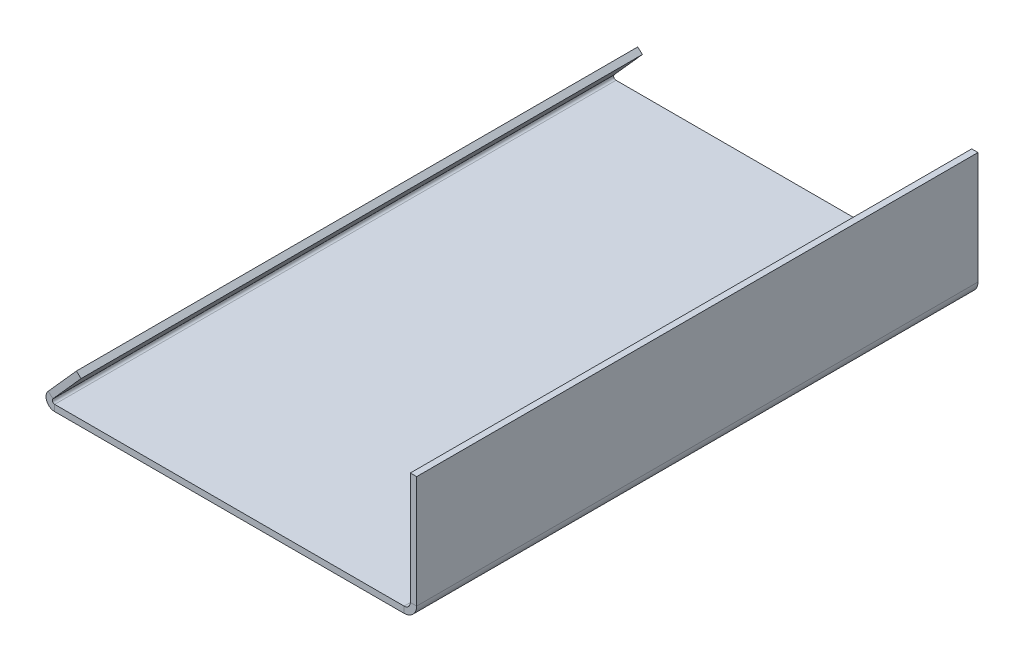
ISO-10303-21;
HEADER;
FILE_DESCRIPTION(('STEP AP214'),'2;1');
FILE_NAME('part.step','',(''),(''),'','','');
FILE_SCHEMA(('AUTOMOTIVE_DESIGN { 1 0 10303 214 1 1 1 1 }'));
ENDSEC;
DATA;
#1=APPLICATION_CONTEXT('core data for automotive mechanical design processes');
#2=APPLICATION_PROTOCOL_DEFINITION('international standard','automotive_design',2000,#1);
#3=PRODUCT_CONTEXT('',#1,'mechanical');
#4=PRODUCT('Part','Part','',(#3));
#5=PRODUCT_RELATED_PRODUCT_CATEGORY('part','',(#4));
#6=PRODUCT_DEFINITION_FORMATION('','',#4);
#7=PRODUCT_DEFINITION_CONTEXT('part definition',#1,'design');
#8=PRODUCT_DEFINITION('design','',#6,#7);
#9=PRODUCT_DEFINITION_SHAPE('','',#8);
#10=(LENGTH_UNIT() NAMED_UNIT(*) SI_UNIT(.MILLI.,.METRE.));
#11=(NAMED_UNIT(*) PLANE_ANGLE_UNIT() SI_UNIT($,.RADIAN.));
#12=(NAMED_UNIT(*) SI_UNIT($,.STERADIAN.) SOLID_ANGLE_UNIT());
#13=UNCERTAINTY_MEASURE_WITH_UNIT(LENGTH_MEASURE(1.E-05),#10,'distance_accuracy_value','');
#14=(GEOMETRIC_REPRESENTATION_CONTEXT(3) GLOBAL_UNCERTAINTY_ASSIGNED_CONTEXT((#13)) GLOBAL_UNIT_ASSIGNED_CONTEXT((#10,
#11,#12)) REPRESENTATION_CONTEXT('',''));
#15=CARTESIAN_POINT('',(0.,0.,0.));
#16=DIRECTION('',(0.,0.,1.));
#17=DIRECTION('',(1.,0.,0.));
#18=AXIS2_PLACEMENT_3D('',#15,#16,#17);
#19=CARTESIAN_POINT('',(-150.168156188515,150.,118.491));
#20=DIRECTION('',(0.,0.,1.));
#21=DIRECTION('',(1.,0.,0.));
#22=AXIS2_PLACEMENT_3D('',#19,#20,#21);
#23=PLANE('',#22);
#24=DIRECTION('',(0.,-1.,0.));
#25=VECTOR('',#24,1.);
#26=CARTESIAN_POINT('',(-150.168156188515,150.,118.491));
#27=LINE('',#26,#25);
#28=CARTESIAN_POINT('',(-150.168156188515,150.,118.491));
#29=VERTEX_POINT('',#28);
#30=CARTESIAN_POINT('',(-150.168156188515,147.34316,118.491));
#31=VERTEX_POINT('',#30);
#32=EDGE_CURVE('E11',#29,#31,#27,.T.);
#33=ORIENTED_EDGE('',*,*,#32,.F.);
#34=CARTESIAN_POINT('',(-150.168156188515,151.,118.491));
#35=DIRECTION('',(0.,0.,-1.));
#36=DIRECTION('',(-1.,0.,0.));
#37=AXIS2_PLACEMENT_3D('',#34,#35,#36);
#38=CIRCLE('',#37,1.);
#39=CARTESIAN_POINT('',(-150.914451622983,151.665614846958,118.491));
#40=VERTEX_POINT('',#39);
#41=EDGE_CURVE('E249',#40,#29,#38,.F.);
#42=ORIENTED_EDGE('',*,*,#41,.F.);
#43=DIRECTION('',(0.746295434468507,-0.665614846958406,0.));
#44=VECTOR('',#43,1.);
#45=CARTESIAN_POINT('',(-152.897239185096,153.434046996951,118.491));
#46=LINE('',#45,#44);
#47=CARTESIAN_POINT('',(-152.897239185096,153.434046996951,118.491));
#48=VERTEX_POINT('',#47);
#49=EDGE_CURVE('E47',#48,#40,#46,.T.);
#50=ORIENTED_EDGE('',*,*,#49,.F.);
#51=CARTESIAN_POINT('',(-150.168156188515,151.,118.491));
#52=DIRECTION('',(0.,0.,1.));
#53=DIRECTION('',(1.,0.,0.));
#54=AXIS2_PLACEMENT_3D('',#51,#52,#53);
#55=CIRCLE('',#54,3.65684);
#56=EDGE_CURVE('E148',#48,#31,#55,.T.);
#57=ORIENTED_EDGE('',*,*,#56,.T.);
#58=EDGE_LOOP('',(#33,#42,#50,#57));
#59=FACE_BOUND('',#58,.T.);
#60=ADVANCED_FACE('F39',(#59),#23,.T.);
#61=CARTESIAN_POINT('',(-152.897239185096,153.434046996951,118.491));
#62=DIRECTION('',(0.,0.,1.));
#63=DIRECTION('',(1.,0.,0.));
#64=AXIS2_PLACEMENT_3D('',#61,#62,#63);
#65=PLANE('',#64);
#66=DIRECTION('',(1.,0.,0.));
#67=VECTOR('',#66,1.);
#68=CARTESIAN_POINT('',(-152.4,150.,118.491));
#69=LINE('',#68,#67);
#70=CARTESIAN_POINT('',(-2.65684000000013,150.,118.491));
#71=VERTEX_POINT('',#70);
#72=EDGE_CURVE('E142',#29,#71,#69,.T.);
#73=ORIENTED_EDGE('',*,*,#72,.F.);
#74=ORIENTED_EDGE('',*,*,#32,.T.);
#75=DIRECTION('',(1.,0.,0.));
#76=VECTOR('',#75,1.);
#77=CARTESIAN_POINT('',(-152.4,147.34316,118.491));
#78=LINE('',#77,#76);
#79=CARTESIAN_POINT('',(-2.65684000000024,147.34316,118.491));
#80=VERTEX_POINT('',#79);
#81=EDGE_CURVE('E139',#31,#80,#78,.T.);
#82=ORIENTED_EDGE('',*,*,#81,.T.);
#83=DIRECTION('',(0.,1.,0.));
#84=VECTOR('',#83,1.);
#85=CARTESIAN_POINT('',(-2.65684000000024,147.34316,118.491));
#86=LINE('',#85,#84);
#87=EDGE_CURVE('E230',#80,#71,#86,.T.);
#88=ORIENTED_EDGE('',*,*,#87,.T.);
#89=EDGE_LOOP('',(#73,#74,#82,#88));
#90=FACE_BOUND('',#89,.T.);
#91=ADVANCED_FACE('F137',(#90),#65,.T.);
#92=CARTESIAN_POINT('',(-150.914451622983,151.665614846958,-118.491));
#93=DIRECTION('',(0.,0.,-1.));
#94=DIRECTION('',(-1.,0.,0.));
#95=AXIS2_PLACEMENT_3D('',#92,#93,#94);
#96=PLANE('',#95);
#97=DIRECTION('',(-0.746295434468507,0.665614846958406,0.));
#98=VECTOR('',#97,1.);
#99=CARTESIAN_POINT('',(-150.914451622983,151.665614846958,-118.491));
#100=LINE('',#99,#98);
#101=CARTESIAN_POINT('',(-150.914451622983,151.665614846958,-118.491));
#102=VERTEX_POINT('',#101);
#103=CARTESIAN_POINT('',(-152.897239185096,153.434046996951,-118.491));
#104=VERTEX_POINT('',#103);
#105=EDGE_CURVE('E235',#102,#104,#100,.T.);
#106=ORIENTED_EDGE('',*,*,#105,.F.);
#107=CARTESIAN_POINT('',(-150.168156188515,151.,-118.491));
#108=DIRECTION('',(0.,0.,-1.));
#109=DIRECTION('',(-1.,0.,0.));
#110=AXIS2_PLACEMENT_3D('',#107,#108,#109);
#111=CIRCLE('',#110,1.);
#112=CARTESIAN_POINT('',(-150.168156188515,150.,-118.491));
#113=VERTEX_POINT('',#112);
#114=EDGE_CURVE('E187',#102,#113,#111,.F.);
#115=ORIENTED_EDGE('',*,*,#114,.T.);
#116=DIRECTION('',(0.,1.,0.));
#117=VECTOR('',#116,1.);
#118=CARTESIAN_POINT('',(-150.168156188515,147.34316,-118.491));
#119=LINE('',#118,#117);
#120=CARTESIAN_POINT('',(-150.168156188515,147.34316,-118.491));
#121=VERTEX_POINT('',#120);
#122=EDGE_CURVE('E233',#121,#113,#119,.T.);
#123=ORIENTED_EDGE('',*,*,#122,.F.);
#124=CARTESIAN_POINT('',(-150.168156188515,151.,-118.491));
#125=DIRECTION('',(0.,0.,1.));
#126=DIRECTION('',(1.,0.,0.));
#127=AXIS2_PLACEMENT_3D('',#124,#125,#126);
#128=CIRCLE('',#127,3.65684);
#129=EDGE_CURVE('E160',#104,#121,#128,.T.);
#130=ORIENTED_EDGE('',*,*,#129,.F.);
#131=EDGE_LOOP('',(#106,#115,#123,#130));
#132=FACE_BOUND('',#131,.T.);
#133=ADVANCED_FACE('F287',(#132),#96,.T.);
#134=CARTESIAN_POINT('',(-150.168156188515,147.34316,-118.491));
#135=DIRECTION('',(0.,0.,-1.));
#136=DIRECTION('',(-1.,0.,0.));
#137=AXIS2_PLACEMENT_3D('',#134,#135,#136);
#138=PLANE('',#137);
#139=DIRECTION('',(-0.665614846958402,-0.74629543446851,0.));
#140=VECTOR('',#139,1.);
#141=CARTESIAN_POINT('',(-139.02177070292,164.999832848241,-118.491));
#142=LINE('',#141,#140);
#143=CARTESIAN_POINT('',(-139.02177070292,164.999832848241,-118.491));
#144=VERTEX_POINT('',#143);
#145=EDGE_CURVE('E190',#144,#102,#142,.T.);
#146=ORIENTED_EDGE('',*,*,#145,.T.);
#147=ORIENTED_EDGE('',*,*,#105,.T.);
#148=DIRECTION('',(-0.665614846958402,-0.74629543446851,0.));
#149=VECTOR('',#148,1.);
#150=CARTESIAN_POINT('',(-141.004558265033,166.768264998234,-118.491));
#151=LINE('',#150,#149);
#152=CARTESIAN_POINT('',(-141.004558265033,166.768264998234,-118.491));
#153=VERTEX_POINT('',#152);
#154=EDGE_CURVE('E196',#153,#104,#151,.T.);
#155=ORIENTED_EDGE('',*,*,#154,.F.);
#156=DIRECTION('',(0.746295434468512,-0.6656148469584,0.));
#157=VECTOR('',#156,1.);
#158=CARTESIAN_POINT('',(-141.004558265033,166.768264998234,-118.491));
#159=LINE('',#158,#157);
#160=EDGE_CURVE('E193',#153,#144,#159,.T.);
#161=ORIENTED_EDGE('',*,*,#160,.T.);
#162=EDGE_LOOP('',(#146,#147,#155,#161));
#163=FACE_BOUND('',#162,.T.);
#164=ADVANCED_FACE('F290',(#163),#138,.T.);
#165=CARTESIAN_POINT('',(0.,152.65684,118.491));
#166=DIRECTION('',(0.,0.,1.));
#167=DIRECTION('',(1.,0.,0.));
#168=AXIS2_PLACEMENT_3D('',#165,#166,#167);
#169=PLANE('',#168);
#170=DIRECTION('',(1.,0.,0.));
#171=VECTOR('',#170,1.);
#172=CARTESIAN_POINT('',(0.,152.65684,118.491));
#173=LINE('',#172,#171);
#174=CARTESIAN_POINT('',(0.,152.65684,118.491));
#175=VERTEX_POINT('',#174);
#176=CARTESIAN_POINT('',(2.65684,152.65684,118.491));
#177=VERTEX_POINT('',#176);
#178=EDGE_CURVE('E55',#175,#177,#173,.T.);
#179=ORIENTED_EDGE('',*,*,#178,.F.);
#180=CARTESIAN_POINT('',(-2.65684000000002,152.65684,118.491));
#181=DIRECTION('',(0.,0.,-1.));
#182=DIRECTION('',(-1.,0.,0.));
#183=AXIS2_PLACEMENT_3D('',#180,#181,#182);
#184=CIRCLE('',#183,2.65684);
#185=EDGE_CURVE('E259',#71,#175,#184,.F.);
#186=ORIENTED_EDGE('',*,*,#185,.F.);
#187=ORIENTED_EDGE('',*,*,#87,.F.);
#188=CARTESIAN_POINT('',(-2.65684000000002,152.65684,118.491));
#189=DIRECTION('',(0.,0.,1.));
#190=DIRECTION('',(1.,0.,0.));
#191=AXIS2_PLACEMENT_3D('',#188,#189,#190);
#192=CIRCLE('',#191,5.31368);
#193=EDGE_CURVE('E168',#80,#177,#192,.T.);
#194=ORIENTED_EDGE('',*,*,#193,.T.);
#195=EDGE_LOOP('',(#179,#186,#187,#194));
#196=FACE_BOUND('',#195,.T.);
#197=ADVANCED_FACE('F282',(#196),#169,.T.);
#198=CARTESIAN_POINT('',(-2.65684000000024,147.34316,118.491));
#199=DIRECTION('',(0.,0.,1.));
#200=DIRECTION('',(1.,0.,0.));
#201=AXIS2_PLACEMENT_3D('',#198,#199,#200);
#202=PLANE('',#201);
#203=DIRECTION('',(0.,1.,0.));
#204=VECTOR('',#203,1.);
#205=CARTESIAN_POINT('',(0.,150.,118.491));
#206=LINE('',#205,#204);
#207=CARTESIAN_POINT('',(0.,200.,118.491));
#208=VERTEX_POINT('',#207);
#209=EDGE_CURVE('E262',#175,#208,#206,.T.);
#210=ORIENTED_EDGE('',*,*,#209,.F.);
#211=ORIENTED_EDGE('',*,*,#178,.T.);
#212=DIRECTION('',(0.,1.,0.));
#213=VECTOR('',#212,1.);
#214=CARTESIAN_POINT('',(2.65684,150.,118.491));
#215=LINE('',#214,#213);
#216=CARTESIAN_POINT('',(2.65684,200.,118.491));
#217=VERTEX_POINT('',#216);
#218=EDGE_CURVE('E109',#177,#217,#215,.T.);
#219=ORIENTED_EDGE('',*,*,#218,.T.);
#220=DIRECTION('',(1.,0.,0.));
#221=VECTOR('',#220,1.);
#222=CARTESIAN_POINT('',(0.,200.,118.491));
#223=LINE('',#222,#221);
#224=EDGE_CURVE('E265',#208,#217,#223,.T.);
#225=ORIENTED_EDGE('',*,*,#224,.F.);
#226=EDGE_LOOP('',(#210,#211,#219,#225));
#227=FACE_BOUND('',#226,.T.);
#228=ADVANCED_FACE('F271',(#227),#202,.T.);
#229=CARTESIAN_POINT('',(-2.65684000000013,150.,-118.491));
#230=DIRECTION('',(0.,0.,-1.));
#231=DIRECTION('',(-1.,0.,0.));
#232=AXIS2_PLACEMENT_3D('',#229,#230,#231);
#233=PLANE('',#232);
#234=DIRECTION('',(0.,-1.,0.));
#235=VECTOR('',#234,1.);
#236=CARTESIAN_POINT('',(-2.65684000000013,150.,-118.491));
#237=LINE('',#236,#235);
#238=CARTESIAN_POINT('',(-2.65684000000013,150.,-118.491));
#239=VERTEX_POINT('',#238);
#240=CARTESIAN_POINT('',(-2.65684000000024,147.34316,-118.491));
#241=VERTEX_POINT('',#240);
#242=EDGE_CURVE('E96',#239,#241,#237,.T.);
#243=ORIENTED_EDGE('',*,*,#242,.F.);
#244=CARTESIAN_POINT('',(-2.65684000000002,152.65684,-118.491));
#245=DIRECTION('',(0.,0.,-1.));
#246=DIRECTION('',(-1.,0.,0.));
#247=AXIS2_PLACEMENT_3D('',#244,#245,#246);
#248=CIRCLE('',#247,2.65684);
#249=CARTESIAN_POINT('',(0.,152.65684,-118.491));
#250=VERTEX_POINT('',#249);
#251=EDGE_CURVE('E183',#239,#250,#248,.F.);
#252=ORIENTED_EDGE('',*,*,#251,.T.);
#253=DIRECTION('',(-1.,0.,0.));
#254=VECTOR('',#253,1.);
#255=CARTESIAN_POINT('',(2.65684,152.65684,-118.491));
#256=LINE('',#255,#254);
#257=CARTESIAN_POINT('',(2.65684,152.65684,-118.491));
#258=VERTEX_POINT('',#257);
#259=EDGE_CURVE('E103',#258,#250,#256,.T.);
#260=ORIENTED_EDGE('',*,*,#259,.F.);
#261=CARTESIAN_POINT('',(-2.65684000000002,152.65684,-118.491));
#262=DIRECTION('',(0.,0.,1.));
#263=DIRECTION('',(1.,0.,0.));
#264=AXIS2_PLACEMENT_3D('',#261,#262,#263);
#265=CIRCLE('',#264,5.31368);
#266=EDGE_CURVE('E202',#241,#258,#265,.T.);
#267=ORIENTED_EDGE('',*,*,#266,.F.);
#268=EDGE_LOOP('',(#243,#252,#260,#267));
#269=FACE_BOUND('',#268,.T.);
#270=ADVANCED_FACE('F319',(#269),#233,.T.);
#271=CARTESIAN_POINT('',(2.65684,152.65684,-118.491));
#272=DIRECTION('',(0.,0.,-1.));
#273=DIRECTION('',(-1.,0.,0.));
#274=AXIS2_PLACEMENT_3D('',#271,#272,#273);
#275=PLANE('',#274);
#276=DIRECTION('',(1.,0.,0.));
#277=VECTOR('',#276,1.);
#278=CARTESIAN_POINT('',(-152.4,150.,-118.491));
#279=LINE('',#278,#277);
#280=EDGE_CURVE('E185',#113,#239,#279,.T.);
#281=ORIENTED_EDGE('',*,*,#280,.T.);
#282=ORIENTED_EDGE('',*,*,#242,.T.);
#283=DIRECTION('',(1.,0.,0.));
#284=VECTOR('',#283,1.);
#285=CARTESIAN_POINT('',(-152.4,147.34316,-118.491));
#286=LINE('',#285,#284);
#287=EDGE_CURVE('E200',#121,#241,#286,.T.);
#288=ORIENTED_EDGE('',*,*,#287,.F.);
#289=ORIENTED_EDGE('',*,*,#122,.T.);
#290=EDGE_LOOP('',(#281,#282,#288,#289));
#291=FACE_BOUND('',#290,.T.);
#292=ADVANCED_FACE('F322',(#291),#275,.T.);
#293=CARTESIAN_POINT('',(2.65684,150.,118.491));
#294=DIRECTION('',(-1.,0.,0.));
#295=DIRECTION('',(0.,0.,1.));
#296=AXIS2_PLACEMENT_3D('',#293,#294,#295);
#297=PLANE('',#296);
#298=DIRECTION('',(0.,1.,0.));
#299=VECTOR('',#298,1.);
#300=CARTESIAN_POINT('',(2.65684,150.,-118.491));
#301=LINE('',#300,#299);
#302=CARTESIAN_POINT('',(2.65684,200.,-118.491));
#303=VERTEX_POINT('',#302);
#304=EDGE_CURVE('E174',#258,#303,#301,.T.);
#305=ORIENTED_EDGE('',*,*,#304,.T.);
#306=DIRECTION('',(0.,0.,-1.));
#307=VECTOR('',#306,1.);
#308=CARTESIAN_POINT('',(2.65684,200.,118.491));
#309=LINE('',#308,#307);
#310=EDGE_CURVE('E226',#217,#303,#309,.T.);
#311=ORIENTED_EDGE('',*,*,#310,.F.);
#312=ORIENTED_EDGE('',*,*,#218,.F.);
#313=DIRECTION('',(0.,0.,-1.));
#314=VECTOR('',#313,1.);
#315=CARTESIAN_POINT('',(2.65684,152.65684,118.491));
#316=LINE('',#315,#314);
#317=EDGE_CURVE('E170',#177,#258,#316,.T.);
#318=ORIENTED_EDGE('',*,*,#317,.T.);
#319=EDGE_LOOP('',(#305,#311,#312,#318));
#320=FACE_BOUND('',#319,.T.);
#321=ADVANCED_FACE('F325',(#320),#297,.F.);
#322=CARTESIAN_POINT('',(0.,200.,118.491));
#323=DIRECTION('',(0.,1.,0.));
#324=DIRECTION('',(0.,0.,1.));
#325=AXIS2_PLACEMENT_3D('',#322,#323,#324);
#326=PLANE('',#325);
#327=DIRECTION('',(1.,0.,0.));
#328=VECTOR('',#327,1.);
#329=CARTESIAN_POINT('',(0.,200.,-118.491));
#330=LINE('',#329,#328);
#331=CARTESIAN_POINT('',(0.,200.,-118.491));
#332=VERTEX_POINT('',#331);
#333=EDGE_CURVE('E177',#332,#303,#330,.T.);
#334=ORIENTED_EDGE('',*,*,#333,.F.);
#335=DIRECTION('',(0.,0.,-1.));
#336=VECTOR('',#335,1.);
#337=CARTESIAN_POINT('',(0.,200.,118.491));
#338=LINE('',#337,#336);
#339=EDGE_CURVE('E224',#208,#332,#338,.T.);
#340=ORIENTED_EDGE('',*,*,#339,.F.);
#341=ORIENTED_EDGE('',*,*,#224,.T.);
#342=ORIENTED_EDGE('',*,*,#310,.T.);
#343=EDGE_LOOP('',(#334,#340,#341,#342));
#344=FACE_BOUND('',#343,.T.);
#345=ADVANCED_FACE('F270',(#344),#326,.T.);
#346=CARTESIAN_POINT('',(0.,150.,118.491));
#347=DIRECTION('',(-1.,0.,0.));
#348=DIRECTION('',(0.,0.,1.));
#349=AXIS2_PLACEMENT_3D('',#346,#347,#348);
#350=PLANE('',#349);
#351=DIRECTION('',(0.,1.,0.));
#352=VECTOR('',#351,1.);
#353=CARTESIAN_POINT('',(0.,150.,-118.491));
#354=LINE('',#353,#352);
#355=EDGE_CURVE('E180',#250,#332,#354,.T.);
#356=ORIENTED_EDGE('',*,*,#355,.F.);
#357=DIRECTION('',(0.,0.,-1.));
#358=VECTOR('',#357,1.);
#359=CARTESIAN_POINT('',(0.,152.65684,118.491));
#360=LINE('',#359,#358);
#361=EDGE_CURVE('E221',#175,#250,#360,.T.);
#362=ORIENTED_EDGE('',*,*,#361,.F.);
#363=ORIENTED_EDGE('',*,*,#209,.T.);
#364=ORIENTED_EDGE('',*,*,#339,.T.);
#365=EDGE_LOOP('',(#356,#362,#363,#364));
#366=FACE_BOUND('',#365,.T.);
#367=ADVANCED_FACE('F275',(#366),#350,.T.);
#368=CARTESIAN_POINT('',(-2.65684000000002,152.65684,118.491));
#369=DIRECTION('',(0.,0.,-1.));
#370=DIRECTION('',(-1.,0.,0.));
#371=AXIS2_PLACEMENT_3D('',#368,#369,#370);
#372=CYLINDRICAL_SURFACE('',#371,2.65684);
#373=ORIENTED_EDGE('',*,*,#251,.F.);
#374=DIRECTION('',(0.,0.,-1.));
#375=VECTOR('',#374,1.);
#376=CARTESIAN_POINT('',(-2.65684000000013,150.,118.491));
#377=LINE('',#376,#375);
#378=EDGE_CURVE('E218',#71,#239,#377,.T.);
#379=ORIENTED_EDGE('',*,*,#378,.F.);
#380=ORIENTED_EDGE('',*,*,#185,.T.);
#381=ORIENTED_EDGE('',*,*,#361,.T.);
#382=EDGE_LOOP('',(#373,#379,#380,#381));
#383=FACE_BOUND('',#382,.T.);
#384=ADVANCED_FACE('F278',(#383),#372,.F.);
#385=CARTESIAN_POINT('',(-152.4,150.,118.491));
#386=DIRECTION('',(0.,1.,0.));
#387=DIRECTION('',(0.,0.,1.));
#388=AXIS2_PLACEMENT_3D('',#385,#386,#387);
#389=PLANE('',#388);
#390=ORIENTED_EDGE('',*,*,#280,.F.);
#391=DIRECTION('',(0.,0.,-1.));
#392=VECTOR('',#391,1.);
#393=CARTESIAN_POINT('',(-150.168156188515,150.,118.491));
#394=LINE('',#393,#392);
#395=EDGE_CURVE('E215',#29,#113,#394,.T.);
#396=ORIENTED_EDGE('',*,*,#395,.F.);
#397=ORIENTED_EDGE('',*,*,#72,.T.);
#398=ORIENTED_EDGE('',*,*,#378,.T.);
#399=EDGE_LOOP('',(#390,#396,#397,#398));
#400=FACE_BOUND('',#399,.T.);
#401=ADVANCED_FACE('F285',(#400),#389,.T.);
#402=CARTESIAN_POINT('',(-150.168156188515,151.,118.491));
#403=DIRECTION('',(0.,0.,-1.));
#404=DIRECTION('',(-1.,0.,0.));
#405=AXIS2_PLACEMENT_3D('',#402,#403,#404);
#406=CYLINDRICAL_SURFACE('',#405,1.);
#407=ORIENTED_EDGE('',*,*,#114,.F.);
#408=DIRECTION('',(0.,0.,-1.));
#409=VECTOR('',#408,1.);
#410=CARTESIAN_POINT('',(-150.914451622983,151.665614846958,118.491));
#411=LINE('',#410,#409);
#412=EDGE_CURVE('E212',#40,#102,#411,.T.);
#413=ORIENTED_EDGE('',*,*,#412,.F.);
#414=ORIENTED_EDGE('',*,*,#41,.T.);
#415=ORIENTED_EDGE('',*,*,#395,.T.);
#416=EDGE_LOOP('',(#407,#413,#414,#415));
#417=FACE_BOUND('',#416,.T.);
#418=ADVANCED_FACE('F248',(#417),#406,.F.);
#419=CARTESIAN_POINT('',(-139.02177070292,164.999832848241,118.491));
#420=DIRECTION('',(0.74629543446851,-0.665614846958402,0.));
#421=DIRECTION('',(0.665614846958402,0.74629543446851,0.));
#422=AXIS2_PLACEMENT_3D('',#419,#420,#421);
#423=PLANE('',#422);
#424=ORIENTED_EDGE('',*,*,#145,.F.);
#425=DIRECTION('',(0.,0.,-1.));
#426=VECTOR('',#425,1.);
#427=CARTESIAN_POINT('',(-139.02177070292,164.999832848241,118.491));
#428=LINE('',#427,#426);
#429=CARTESIAN_POINT('',(-139.02177070292,164.999832848241,118.491));
#430=VERTEX_POINT('',#429);
#431=EDGE_CURVE('E210',#430,#144,#428,.T.);
#432=ORIENTED_EDGE('',*,*,#431,.F.);
#433=DIRECTION('',(-0.665614846958402,-0.74629543446851,0.));
#434=VECTOR('',#433,1.);
#435=CARTESIAN_POINT('',(-139.02177070292,164.999832848241,118.491));
#436=LINE('',#435,#434);
#437=EDGE_CURVE('E242',#430,#40,#436,.T.);
#438=ORIENTED_EDGE('',*,*,#437,.T.);
#439=ORIENTED_EDGE('',*,*,#412,.T.);
#440=EDGE_LOOP('',(#424,#432,#438,#439));
#441=FACE_BOUND('',#440,.T.);
#442=ADVANCED_FACE('F253',(#441),#423,.T.);
#443=CARTESIAN_POINT('',(-141.004558265033,166.768264998234,118.491));
#444=DIRECTION('',(0.6656148469584,0.746295434468512,0.));
#445=DIRECTION('',(-0.746295434468512,0.6656148469584,0.));
#446=AXIS2_PLACEMENT_3D('',#443,#444,#445);
#447=PLANE('',#446);
#448=ORIENTED_EDGE('',*,*,#160,.F.);
#449=DIRECTION('',(0.,0.,-1.));
#450=VECTOR('',#449,1.);
#451=CARTESIAN_POINT('',(-141.004558265033,166.768264998234,118.491));
#452=LINE('',#451,#450);
#453=CARTESIAN_POINT('',(-141.004558265033,166.768264998234,118.491));
#454=VERTEX_POINT('',#453);
#455=EDGE_CURVE('E208',#454,#153,#452,.T.);
#456=ORIENTED_EDGE('',*,*,#455,.F.);
#457=DIRECTION('',(0.746295434468512,-0.6656148469584,0.));
#458=VECTOR('',#457,1.);
#459=CARTESIAN_POINT('',(-141.004558265033,166.768264998234,118.491));
#460=LINE('',#459,#458);
#461=EDGE_CURVE('E254',#454,#430,#460,.T.);
#462=ORIENTED_EDGE('',*,*,#461,.T.);
#463=ORIENTED_EDGE('',*,*,#431,.T.);
#464=EDGE_LOOP('',(#448,#456,#462,#463));
#465=FACE_BOUND('',#464,.T.);
#466=ADVANCED_FACE('F295',(#465),#447,.T.);
#467=CARTESIAN_POINT('',(-141.004558265033,166.768264998234,118.491));
#468=DIRECTION('',(0.74629543446851,-0.665614846958402,0.));
#469=DIRECTION('',(0.665614846958402,0.74629543446851,0.));
#470=AXIS2_PLACEMENT_3D('',#467,#468,#469);
#471=PLANE('',#470);
#472=ORIENTED_EDGE('',*,*,#154,.T.);
#473=DIRECTION('',(0.,0.,-1.));
#474=VECTOR('',#473,1.);
#475=CARTESIAN_POINT('',(-152.897239185096,153.434046996951,118.491));
#476=LINE('',#475,#474);
#477=EDGE_CURVE('E162',#48,#104,#476,.T.);
#478=ORIENTED_EDGE('',*,*,#477,.F.);
#479=DIRECTION('',(-0.665614846958402,-0.74629543446851,0.));
#480=VECTOR('',#479,1.);
#481=CARTESIAN_POINT('',(-141.004558265033,166.768264998234,118.491));
#482=LINE('',#481,#480);
#483=EDGE_CURVE('E153',#454,#48,#482,.T.);
#484=ORIENTED_EDGE('',*,*,#483,.F.);
#485=ORIENTED_EDGE('',*,*,#455,.T.);
#486=EDGE_LOOP('',(#472,#478,#484,#485));
#487=FACE_BOUND('',#486,.T.);
#488=ADVANCED_FACE('F293',(#487),#471,.F.);
#489=CARTESIAN_POINT('',(-150.168156188515,151.,118.491));
#490=DIRECTION('',(0.,0.,-1.));
#491=DIRECTION('',(-1.,0.,0.));
#492=AXIS2_PLACEMENT_3D('',#489,#490,#491);
#493=CYLINDRICAL_SURFACE('',#492,3.65684);
#494=ORIENTED_EDGE('',*,*,#129,.T.);
#495=DIRECTION('',(0.,0.,-1.));
#496=VECTOR('',#495,1.);
#497=CARTESIAN_POINT('',(-150.168156188515,147.34316,118.491));
#498=LINE('',#497,#496);
#499=EDGE_CURVE('E157',#31,#121,#498,.T.);
#500=ORIENTED_EDGE('',*,*,#499,.F.);
#501=ORIENTED_EDGE('',*,*,#56,.F.);
#502=ORIENTED_EDGE('',*,*,#477,.T.);
#503=EDGE_LOOP('',(#494,#500,#501,#502));
#504=FACE_BOUND('',#503,.T.);
#505=ADVANCED_FACE('F158',(#504),#493,.T.);
#506=CARTESIAN_POINT('',(-152.4,147.34316,118.491));
#507=DIRECTION('',(0.,1.,0.));
#508=DIRECTION('',(0.,0.,1.));
#509=AXIS2_PLACEMENT_3D('',#506,#507,#508);
#510=PLANE('',#509);
#511=ORIENTED_EDGE('',*,*,#287,.T.);
#512=DIRECTION('',(0.,0.,-1.));
#513=VECTOR('',#512,1.);
#514=CARTESIAN_POINT('',(-2.65684000000024,147.34316,118.491));
#515=LINE('',#514,#513);
#516=EDGE_CURVE('E163',#80,#241,#515,.T.);
#517=ORIENTED_EDGE('',*,*,#516,.F.);
#518=ORIENTED_EDGE('',*,*,#81,.F.);
#519=ORIENTED_EDGE('',*,*,#499,.T.);
#520=EDGE_LOOP('',(#511,#517,#518,#519));
#521=FACE_BOUND('',#520,.T.);
#522=ADVANCED_FACE('F165',(#521),#510,.F.);
#523=CARTESIAN_POINT('',(-2.65684000000002,152.65684,118.491));
#524=DIRECTION('',(0.,0.,-1.));
#525=DIRECTION('',(-1.,0.,0.));
#526=AXIS2_PLACEMENT_3D('',#523,#524,#525);
#527=CYLINDRICAL_SURFACE('',#526,5.31368);
#528=ORIENTED_EDGE('',*,*,#266,.T.);
#529=ORIENTED_EDGE('',*,*,#317,.F.);
#530=ORIENTED_EDGE('',*,*,#193,.F.);
#531=ORIENTED_EDGE('',*,*,#516,.T.);
#532=EDGE_LOOP('',(#528,#529,#530,#531));
#533=FACE_BOUND('',#532,.T.);
#534=ADVANCED_FACE('F377',(#533),#527,.T.);
#535=CARTESIAN_POINT('',(-2.65684000000002,152.65684,118.491));
#536=DIRECTION('',(0.,0.,-1.));
#537=DIRECTION('',(-1.,0.,0.));
#538=AXIS2_PLACEMENT_3D('',#535,#536,#537);
#539=PLANE('',#538);
#540=ORIENTED_EDGE('',*,*,#483,.T.);
#541=ORIENTED_EDGE('',*,*,#49,.T.);
#542=ORIENTED_EDGE('',*,*,#437,.F.);
#543=ORIENTED_EDGE('',*,*,#461,.F.);
#544=EDGE_LOOP('',(#540,#541,#542,#543));
#545=FACE_BOUND('',#544,.T.);
#546=ADVANCED_FACE('F239',(#545),#539,.F.);
#547=CARTESIAN_POINT('',(-2.65684000000002,152.65684,-118.491));
#548=DIRECTION('',(0.,0.,-1.));
#549=DIRECTION('',(-1.,0.,0.));
#550=AXIS2_PLACEMENT_3D('',#547,#548,#549);
#551=PLANE('',#550);
#552=ORIENTED_EDGE('',*,*,#304,.F.);
#553=ORIENTED_EDGE('',*,*,#259,.T.);
#554=ORIENTED_EDGE('',*,*,#355,.T.);
#555=ORIENTED_EDGE('',*,*,#333,.T.);
#556=EDGE_LOOP('',(#552,#553,#554,#555));
#557=FACE_BOUND('',#556,.T.);
#558=ADVANCED_FACE('F397',(#557),#551,.T.);
#559=CLOSED_SHELL('',(#60,#91,#133,#164,#197,#228,#270,#292,#321,#345,#367,#384,#401,#418,#442,
#466,#488,#505,#522,#534,#546,#558));
#560=MANIFOLD_SOLID_BREP('B2',#559);
#561=ADVANCED_BREP_SHAPE_REPRESENTATION('',(#18,#560),#14);
#562=SHAPE_DEFINITION_REPRESENTATION(#9,#561);
ENDSEC;
END-ISO-10303-21;
